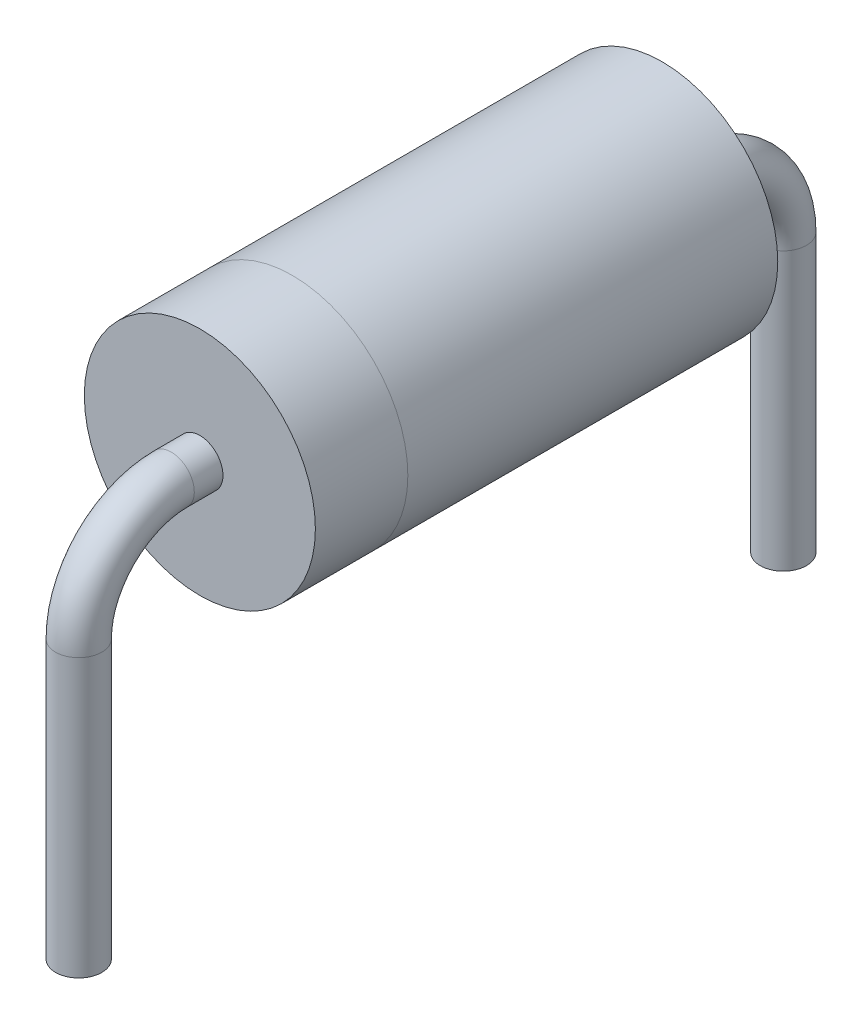
ISO-10303-21;
HEADER;
FILE_DESCRIPTION(('STEP AP214'),'2;1');
FILE_NAME('part.step','',(''),(''),'','','');
FILE_SCHEMA(('AUTOMOTIVE_DESIGN { 1 0 10303 214 1 1 1 1 }'));
ENDSEC;
DATA;
#1=APPLICATION_CONTEXT('core data for automotive mechanical design processes');
#2=APPLICATION_PROTOCOL_DEFINITION('international standard','automotive_design',2000,#1);
#3=PRODUCT_CONTEXT('',#1,'mechanical');
#4=PRODUCT('Part','Part','',(#3));
#5=PRODUCT_RELATED_PRODUCT_CATEGORY('part','',(#4));
#6=PRODUCT_DEFINITION_FORMATION('','',#4);
#7=PRODUCT_DEFINITION_CONTEXT('part definition',#1,'design');
#8=PRODUCT_DEFINITION('design','',#6,#7);
#9=PRODUCT_DEFINITION_SHAPE('','',#8);
#10=(LENGTH_UNIT() NAMED_UNIT(*) SI_UNIT(.MILLI.,.METRE.));
#11=(NAMED_UNIT(*) PLANE_ANGLE_UNIT() SI_UNIT($,.RADIAN.));
#12=(NAMED_UNIT(*) SI_UNIT($,.STERADIAN.) SOLID_ANGLE_UNIT());
#13=UNCERTAINTY_MEASURE_WITH_UNIT(LENGTH_MEASURE(1.E-05),#10,'distance_accuracy_value','');
#14=(GEOMETRIC_REPRESENTATION_CONTEXT(3) GLOBAL_UNCERTAINTY_ASSIGNED_CONTEXT((#13)) GLOBAL_UNIT_ASSIGNED_CONTEXT((#10,
#11,#12)) REPRESENTATION_CONTEXT('',''));
#15=CARTESIAN_POINT('',(0.,0.,0.));
#16=DIRECTION('',(0.,0.,1.));
#17=DIRECTION('',(1.,0.,0.));
#18=AXIS2_PLACEMENT_3D('',#15,#16,#17);
#19=CARTESIAN_POINT('',(0.,0.,5.));
#20=DIRECTION('',(0.,0.,1.));
#21=DIRECTION('',(1.,0.,0.));
#22=AXIS2_PLACEMENT_3D('',#19,#20,#21);
#23=PLANE('',#22);
#24=CARTESIAN_POINT('',(0.,0.,5.));
#25=DIRECTION('',(0.,0.,1.));
#26=DIRECTION('',(1.,0.,0.));
#27=AXIS2_PLACEMENT_3D('',#24,#25,#26);
#28=CIRCLE('',#27,1.2495);
#29=CARTESIAN_POINT('',(1.2495,0.,5.));
#30=VERTEX_POINT('',#29);
#31=EDGE_CURVE('E47',#30,#30,#28,.T.);
#32=ORIENTED_EDGE('',*,*,#31,.T.);
#33=EDGE_LOOP('',(#32));
#34=FACE_BOUND('',#33,.T.);
#35=CARTESIAN_POINT('',(0.,0.,5.));
#36=DIRECTION('',(0.,0.,1.));
#37=DIRECTION('',(1.,0.,0.));
#38=AXIS2_PLACEMENT_3D('',#35,#36,#37);
#39=CIRCLE('',#38,0.25);
#40=CARTESIAN_POINT('',(0.25,0.,5.));
#41=VERTEX_POINT('',#40);
#42=EDGE_CURVE('E100',#41,#41,#39,.T.);
#43=ORIENTED_EDGE('',*,*,#42,.F.);
#44=EDGE_LOOP('',(#43));
#45=FACE_BOUND('',#44,.T.);
#46=ADVANCED_FACE('F32',(#34,#45),#23,.T.);
#47=CARTESIAN_POINT('',(0.,0.,4.));
#48=DIRECTION('',(0.,0.,-1.));
#49=DIRECTION('',(-1.,0.,0.));
#50=AXIS2_PLACEMENT_3D('',#47,#48,#49);
#51=CYLINDRICAL_SURFACE('',#50,1.25);
#52=CARTESIAN_POINT('',(0.,0.,4.));
#53=DIRECTION('',(0.,0.,1.));
#54=DIRECTION('',(1.,0.,0.));
#55=AXIS2_PLACEMENT_3D('',#52,#53,#54);
#56=CIRCLE('',#55,1.2495);
#57=CARTESIAN_POINT('',(1.2495,0.,4.));
#58=VERTEX_POINT('',#57);
#59=EDGE_CURVE('E10',#58,#58,#56,.T.);
#60=ORIENTED_EDGE('',*,*,#59,.F.);
#61=EDGE_LOOP('',(#60));
#62=FACE_BOUND('',#61,.T.);
#63=CARTESIAN_POINT('',(0.,0.,0.));
#64=DIRECTION('',(0.,0.,1.));
#65=DIRECTION('',(1.,0.,0.));
#66=AXIS2_PLACEMENT_3D('',#63,#64,#65);
#67=CIRCLE('',#66,1.25);
#68=CARTESIAN_POINT('',(1.25,0.,0.));
#69=VERTEX_POINT('',#68);
#70=EDGE_CURVE('E42',#69,#69,#67,.T.);
#71=ORIENTED_EDGE('',*,*,#70,.T.);
#72=EDGE_LOOP('',(#71));
#73=FACE_BOUND('',#72,.T.);
#74=ADVANCED_FACE('F34',(#62,#73),#51,.T.);
#75=CARTESIAN_POINT('',(0.,0.,0.));
#76=DIRECTION('',(0.,0.,1.));
#77=DIRECTION('',(1.,0.,0.));
#78=AXIS2_PLACEMENT_3D('',#75,#76,#77);
#79=PLANE('',#78);
#80=CARTESIAN_POINT('',(0.,0.,0.));
#81=DIRECTION('',(0.,0.,1.));
#82=DIRECTION('',(1.,0.,0.));
#83=AXIS2_PLACEMENT_3D('',#80,#81,#82);
#84=CIRCLE('',#83,0.25);
#85=CARTESIAN_POINT('',(0.25,0.,0.));
#86=VERTEX_POINT('',#85);
#87=EDGE_CURVE('E112',#86,#86,#84,.T.);
#88=ORIENTED_EDGE('',*,*,#87,.T.);
#89=EDGE_LOOP('',(#88));
#90=FACE_BOUND('',#89,.T.);
#91=ORIENTED_EDGE('',*,*,#70,.F.);
#92=EDGE_LOOP('',(#91));
#93=FACE_BOUND('',#92,.T.);
#94=ADVANCED_FACE('F60',(#90,#93),#79,.F.);
#95=CARTESIAN_POINT('',(0.,0.,5.));
#96=DIRECTION('',(0.,0.,-1.));
#97=DIRECTION('',(-1.,0.,0.));
#98=AXIS2_PLACEMENT_3D('',#95,#96,#97);
#99=CYLINDRICAL_SURFACE('',#98,1.2495);
#100=ORIENTED_EDGE('',*,*,#31,.F.);
#101=EDGE_LOOP('',(#100));
#102=FACE_BOUND('',#101,.T.);
#103=ORIENTED_EDGE('',*,*,#59,.T.);
#104=EDGE_LOOP('',(#103));
#105=FACE_BOUND('',#104,.T.);
#106=ADVANCED_FACE('F65',(#102,#105),#99,.T.);
#107=CARTESIAN_POINT('',(0.,-1.,6.31));
#108=DIRECTION('',(0.,-1.,0.));
#109=DIRECTION('',(0.,0.,-1.));
#110=AXIS2_PLACEMENT_3D('',#107,#108,#109);
#111=CYLINDRICAL_SURFACE('',#110,0.25);
#112=CARTESIAN_POINT('',(0.,-1.,6.31));
#113=DIRECTION('',(0.,-1.,0.));
#114=DIRECTION('',(1.,0.,0.));
#115=AXIS2_PLACEMENT_3D('',#112,#113,#114);
#116=CIRCLE('',#115,0.25);
#117=CARTESIAN_POINT('',(0.,-1.,6.56));
#118=VERTEX_POINT('',#117);
#119=EDGE_CURVE('E92',#118,#118,#116,.T.);
#120=ORIENTED_EDGE('',*,*,#119,.T.);
#121=EDGE_LOOP('',(#120));
#122=FACE_BOUND('',#121,.T.);
#123=CARTESIAN_POINT('',(0.,-4.,6.31));
#124=DIRECTION('',(0.,-1.,0.));
#125=DIRECTION('',(1.,0.,0.));
#126=AXIS2_PLACEMENT_3D('',#123,#124,#125);
#127=CIRCLE('',#126,0.25);
#128=CARTESIAN_POINT('',(0.25,-4.,6.31));
#129=VERTEX_POINT('',#128);
#130=EDGE_CURVE('E52',#129,#129,#127,.T.);
#131=ORIENTED_EDGE('',*,*,#130,.F.);
#132=EDGE_LOOP('',(#131));
#133=FACE_BOUND('',#132,.T.);
#134=ADVANCED_FACE('F73',(#122,#133),#111,.T.);
#135=CARTESIAN_POINT('',(0.,-1.,5.31));
#136=DIRECTION('',(1.,0.,0.));
#137=DIRECTION('',(0.,0.,-1.));
#138=AXIS2_PLACEMENT_3D('',#135,#136,#137);
#139=TOROIDAL_SURFACE('',#138,1.,0.25);
#140=CARTESIAN_POINT('',(0.,0.,5.31));
#141=DIRECTION('',(0.,0.,1.));
#142=DIRECTION('',(1.,0.,0.));
#143=AXIS2_PLACEMENT_3D('',#140,#141,#142);
#144=CIRCLE('',#143,0.25);
#145=CARTESIAN_POINT('',(0.,0.25,5.31));
#146=VERTEX_POINT('',#145);
#147=EDGE_CURVE('E97',#146,#146,#144,.T.);
#148=CARTESIAN_POINT('',(0.,-1.,5.31));
#149=DIRECTION('',(1.,0.,0.));
#150=DIRECTION('',(0.,0.,-1.));
#151=AXIS2_PLACEMENT_3D('',#148,#149,#150);
#152=CIRCLE('',#151,1.25);
#153=EDGE_CURVE('',#146,#118,#152,.T.);
#154=ORIENTED_EDGE('',*,*,#147,.T.);
#155=ORIENTED_EDGE('',*,*,#119,.F.);
#156=ORIENTED_EDGE('',*,*,#153,.T.);
#157=ORIENTED_EDGE('',*,*,#153,.F.);
#158=EDGE_LOOP('',(#154,#156,#155,#157));
#159=FACE_BOUND('',#158,.T.);
#160=ADVANCED_FACE('F81',(#159),#139,.T.);
#161=CARTESIAN_POINT('',(0.,0.,5.31));
#162=DIRECTION('',(0.,0.,-1.));
#163=DIRECTION('',(-1.,0.,0.));
#164=AXIS2_PLACEMENT_3D('',#161,#162,#163);
#165=CYLINDRICAL_SURFACE('',#164,0.25);
#166=ORIENTED_EDGE('',*,*,#147,.F.);
#167=EDGE_LOOP('',(#166));
#168=FACE_BOUND('',#167,.T.);
#169=ORIENTED_EDGE('',*,*,#42,.T.);
#170=EDGE_LOOP('',(#169));
#171=FACE_BOUND('',#170,.T.);
#172=ADVANCED_FACE('F87',(#168,#171),#165,.T.);
#173=CARTESIAN_POINT('',(0.,-4.,6.31));
#174=DIRECTION('',(0.,-1.,0.));
#175=DIRECTION('',(1.,0.,0.));
#176=AXIS2_PLACEMENT_3D('',#173,#174,#175);
#177=PLANE('',#176);
#178=ORIENTED_EDGE('',*,*,#130,.T.);
#179=EDGE_LOOP('',(#178));
#180=FACE_BOUND('',#179,.T.);
#181=ADVANCED_FACE('F130',(#180),#177,.T.);
#182=CARTESIAN_POINT('',(0.,-1.,-1.31));
#183=DIRECTION('',(0.,-1.,0.));
#184=DIRECTION('',(0.,0.,-1.));
#185=AXIS2_PLACEMENT_3D('',#182,#183,#184);
#186=CYLINDRICAL_SURFACE('',#185,0.25);
#187=CARTESIAN_POINT('',(0.,-1.,-1.31));
#188=DIRECTION('',(0.,1.,0.));
#189=DIRECTION('',(1.,0.,0.));
#190=AXIS2_PLACEMENT_3D('',#187,#188,#189);
#191=CIRCLE('',#190,0.25);
#192=CARTESIAN_POINT('',(0.,-1.,-1.56));
#193=VERTEX_POINT('',#192);
#194=EDGE_CURVE('E108',#193,#193,#191,.T.);
#195=ORIENTED_EDGE('',*,*,#194,.F.);
#196=EDGE_LOOP('',(#195));
#197=FACE_BOUND('',#196,.T.);
#198=CARTESIAN_POINT('',(0.,-4.,-1.31));
#199=DIRECTION('',(0.,1.,0.));
#200=DIRECTION('',(1.,0.,0.));
#201=AXIS2_PLACEMENT_3D('',#198,#199,#200);
#202=CIRCLE('',#201,0.25);
#203=CARTESIAN_POINT('',(0.25,-4.,-1.31));
#204=VERTEX_POINT('',#203);
#205=EDGE_CURVE('E103',#204,#204,#202,.T.);
#206=ORIENTED_EDGE('',*,*,#205,.T.);
#207=EDGE_LOOP('',(#206));
#208=FACE_BOUND('',#207,.T.);
#209=ADVANCED_FACE('F124',(#197,#208),#186,.T.);
#210=CARTESIAN_POINT('',(0.,-1.,-0.309999999999999));
#211=DIRECTION('',(-1.,0.,0.));
#212=DIRECTION('',(0.,0.,1.));
#213=AXIS2_PLACEMENT_3D('',#210,#211,#212);
#214=TOROIDAL_SURFACE('',#213,1.,0.25);
#215=CARTESIAN_POINT('',(0.,0.,-0.309999999999999));
#216=DIRECTION('',(0.,0.,1.));
#217=DIRECTION('',(1.,0.,0.));
#218=AXIS2_PLACEMENT_3D('',#215,#216,#217);
#219=CIRCLE('',#218,0.25);
#220=CARTESIAN_POINT('',(0.,0.25,-0.309999999999999));
#221=VERTEX_POINT('',#220);
#222=EDGE_CURVE('E111',#221,#221,#219,.T.);
#223=CARTESIAN_POINT('',(0.,-1.,-0.309999999999999));
#224=DIRECTION('',(-1.,0.,0.));
#225=DIRECTION('',(0.,0.,1.));
#226=AXIS2_PLACEMENT_3D('',#223,#224,#225);
#227=CIRCLE('',#226,1.25);
#228=EDGE_CURVE('',#221,#193,#227,.T.);
#229=ORIENTED_EDGE('',*,*,#222,.F.);
#230=ORIENTED_EDGE('',*,*,#194,.T.);
#231=ORIENTED_EDGE('',*,*,#228,.T.);
#232=ORIENTED_EDGE('',*,*,#228,.F.);
#233=EDGE_LOOP('',(#229,#231,#230,#232));
#234=FACE_BOUND('',#233,.T.);
#235=ADVANCED_FACE('F121',(#234),#214,.T.);
#236=CARTESIAN_POINT('',(0.,0.,-0.309999999999999));
#237=DIRECTION('',(0.,0.,1.));
#238=DIRECTION('',(1.,0.,0.));
#239=AXIS2_PLACEMENT_3D('',#236,#237,#238);
#240=CYLINDRICAL_SURFACE('',#239,0.25);
#241=ORIENTED_EDGE('',*,*,#222,.T.);
#242=EDGE_LOOP('',(#241));
#243=FACE_BOUND('',#242,.T.);
#244=ORIENTED_EDGE('',*,*,#87,.F.);
#245=EDGE_LOOP('',(#244));
#246=FACE_BOUND('',#245,.T.);
#247=ADVANCED_FACE('F118',(#243,#246),#240,.T.);
#248=CARTESIAN_POINT('',(0.,-4.,-1.31));
#249=DIRECTION('',(0.,-1.,0.));
#250=DIRECTION('',(1.,0.,0.));
#251=AXIS2_PLACEMENT_3D('',#248,#249,#250);
#252=PLANE('',#251);
#253=ORIENTED_EDGE('',*,*,#205,.F.);
#254=EDGE_LOOP('',(#253));
#255=FACE_BOUND('',#254,.T.);
#256=ADVANCED_FACE('F134',(#255),#252,.T.);
#257=CLOSED_SHELL('',(#46,#74,#94,#106,#134,#160,#172,#181,#209,#235,#247,#256));
#258=MANIFOLD_SOLID_BREP('B2',#257);
#259=ADVANCED_BREP_SHAPE_REPRESENTATION('',(#18,#258),#14);
#260=SHAPE_DEFINITION_REPRESENTATION(#9,#259);
ENDSEC;
END-ISO-10303-21;
